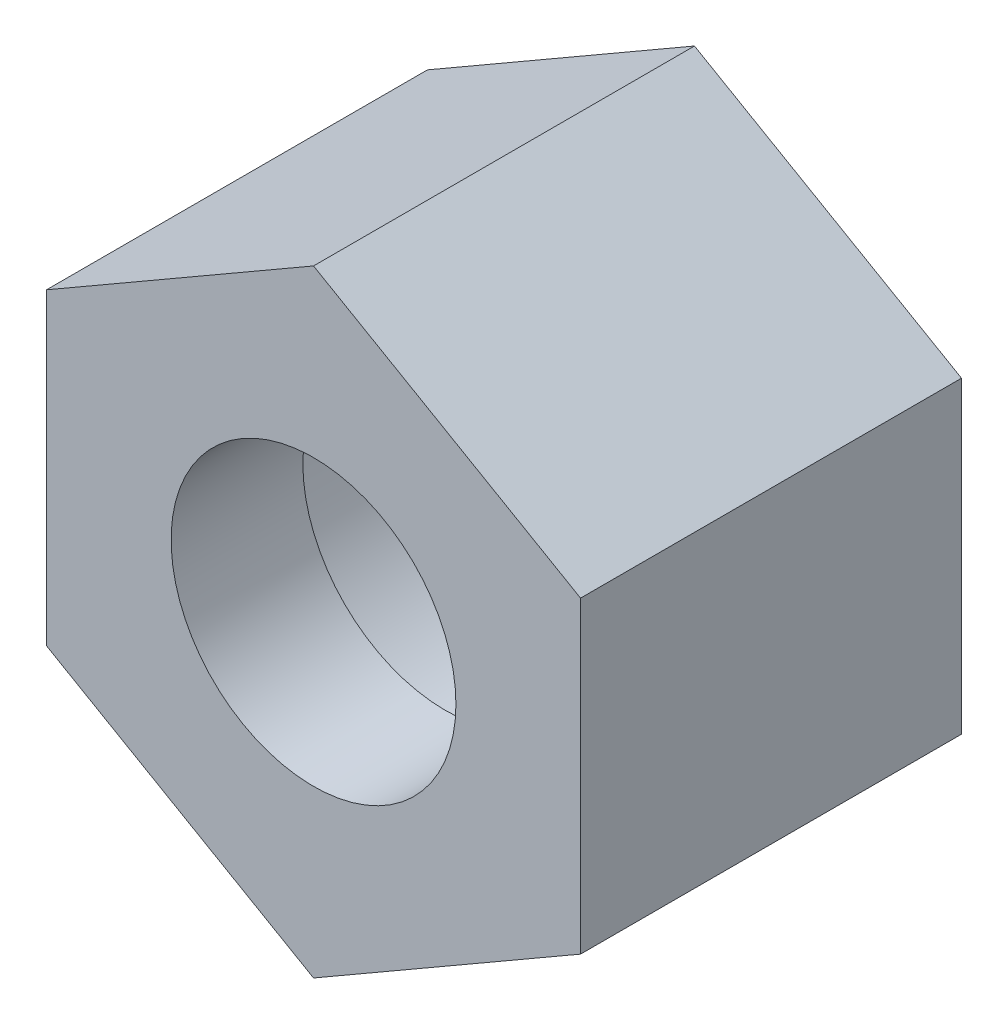
ISO-10303-21;
HEADER;
FILE_DESCRIPTION(('STEP AP214'),'2;1');
FILE_NAME('part.step','',(''),(''),'','','');
FILE_SCHEMA(('AUTOMOTIVE_DESIGN { 1 0 10303 214 1 1 1 1 }'));
ENDSEC;
DATA;
#1=APPLICATION_CONTEXT('core data for automotive mechanical design processes');
#2=APPLICATION_PROTOCOL_DEFINITION('international standard','automotive_design',2000,#1);
#3=PRODUCT_CONTEXT('',#1,'mechanical');
#4=PRODUCT('Part','Part','',(#3));
#5=PRODUCT_RELATED_PRODUCT_CATEGORY('part','',(#4));
#6=PRODUCT_DEFINITION_FORMATION('','',#4);
#7=PRODUCT_DEFINITION_CONTEXT('part definition',#1,'design');
#8=PRODUCT_DEFINITION('design','',#6,#7);
#9=PRODUCT_DEFINITION_SHAPE('','',#8);
#10=(LENGTH_UNIT() NAMED_UNIT(*) SI_UNIT(.MILLI.,.METRE.));
#11=(NAMED_UNIT(*) PLANE_ANGLE_UNIT() SI_UNIT($,.RADIAN.));
#12=(NAMED_UNIT(*) SI_UNIT($,.STERADIAN.) SOLID_ANGLE_UNIT());
#13=UNCERTAINTY_MEASURE_WITH_UNIT(LENGTH_MEASURE(1.E-05),#10,'distance_accuracy_value','');
#14=(GEOMETRIC_REPRESENTATION_CONTEXT(3) GLOBAL_UNCERTAINTY_ASSIGNED_CONTEXT((#13)) GLOBAL_UNIT_ASSIGNED_CONTEXT((#10,
#11,#12)) REPRESENTATION_CONTEXT('',''));
#15=CARTESIAN_POINT('',(0.,0.,0.));
#16=DIRECTION('',(0.,0.,1.));
#17=DIRECTION('',(1.,0.,0.));
#18=AXIS2_PLACEMENT_3D('',#15,#16,#17);
#19=CARTESIAN_POINT('',(15.,8.66025403784439,21.4));
#20=DIRECTION('',(-0.5,-0.866025403784439,0.));
#21=DIRECTION('',(0.866025403784439,-0.5,0.));
#22=AXIS2_PLACEMENT_3D('',#19,#20,#21);
#23=PLANE('',#22);
#24=DIRECTION('',(-0.866025403784439,0.5,0.));
#25=VECTOR('',#24,1.);
#26=CARTESIAN_POINT('',(15.,8.66025403784439,0.));
#27=LINE('',#26,#25);
#28=CARTESIAN_POINT('',(15.,8.66025403784439,0.));
#29=VERTEX_POINT('',#28);
#30=CARTESIAN_POINT('',(0.,17.3205080756888,0.));
#31=VERTEX_POINT('',#30);
#32=EDGE_CURVE('E119',#29,#31,#27,.T.);
#33=ORIENTED_EDGE('',*,*,#32,.T.);
#34=DIRECTION('',(0.,0.,-1.));
#35=VECTOR('',#34,1.);
#36=CARTESIAN_POINT('',(0.,17.3205080756888,21.4));
#37=LINE('',#36,#35);
#38=CARTESIAN_POINT('',(0.,17.3205080756888,21.4));
#39=VERTEX_POINT('',#38);
#40=EDGE_CURVE('E11',#39,#31,#37,.T.);
#41=ORIENTED_EDGE('',*,*,#40,.F.);
#42=DIRECTION('',(-0.866025403784439,0.5,0.));
#43=VECTOR('',#42,1.);
#44=CARTESIAN_POINT('',(15.,8.66025403784439,21.4));
#45=LINE('',#44,#43);
#46=CARTESIAN_POINT('',(15.,8.66025403784439,21.4));
#47=VERTEX_POINT('',#46);
#48=EDGE_CURVE('E130',#47,#39,#45,.T.);
#49=ORIENTED_EDGE('',*,*,#48,.F.);
#50=DIRECTION('',(0.,0.,-1.));
#51=VECTOR('',#50,1.);
#52=CARTESIAN_POINT('',(15.,8.66025403784439,21.4));
#53=LINE('',#52,#51);
#54=EDGE_CURVE('E115',#47,#29,#53,.T.);
#55=ORIENTED_EDGE('',*,*,#54,.T.);
#56=EDGE_LOOP('',(#33,#41,#49,#55));
#57=FACE_BOUND('',#56,.T.);
#58=ADVANCED_FACE('F34',(#57),#23,.F.);
#59=CARTESIAN_POINT('',(0.,17.3205080756888,21.4));
#60=DIRECTION('',(0.5,-0.866025403784439,0.));
#61=DIRECTION('',(0.866025403784439,0.5,0.));
#62=AXIS2_PLACEMENT_3D('',#59,#60,#61);
#63=PLANE('',#62);
#64=DIRECTION('',(-0.866025403784439,-0.5,0.));
#65=VECTOR('',#64,1.);
#66=CARTESIAN_POINT('',(0.,17.3205080756888,0.));
#67=LINE('',#66,#65);
#68=CARTESIAN_POINT('',(-15.,8.66025403784439,0.));
#69=VERTEX_POINT('',#68);
#70=EDGE_CURVE('E122',#31,#69,#67,.T.);
#71=ORIENTED_EDGE('',*,*,#70,.T.);
#72=DIRECTION('',(0.,0.,-1.));
#73=VECTOR('',#72,1.);
#74=CARTESIAN_POINT('',(-15.,8.66025403784439,21.4));
#75=LINE('',#74,#73);
#76=CARTESIAN_POINT('',(-15.,8.66025403784439,21.4));
#77=VERTEX_POINT('',#76);
#78=EDGE_CURVE('E43',#77,#69,#75,.T.);
#79=ORIENTED_EDGE('',*,*,#78,.F.);
#80=DIRECTION('',(-0.866025403784439,-0.5,0.));
#81=VECTOR('',#80,1.);
#82=CARTESIAN_POINT('',(0.,17.3205080756888,21.4));
#83=LINE('',#82,#81);
#84=EDGE_CURVE('E88',#39,#77,#83,.T.);
#85=ORIENTED_EDGE('',*,*,#84,.F.);
#86=ORIENTED_EDGE('',*,*,#40,.T.);
#87=EDGE_LOOP('',(#71,#79,#85,#86));
#88=FACE_BOUND('',#87,.T.);
#89=ADVANCED_FACE('F156',(#88),#63,.F.);
#90=CARTESIAN_POINT('',(-15.,8.66025403784439,21.4));
#91=DIRECTION('',(1.,0.,0.));
#92=DIRECTION('',(0.,1.,0.));
#93=AXIS2_PLACEMENT_3D('',#90,#91,#92);
#94=PLANE('',#93);
#95=DIRECTION('',(0.,-1.,0.));
#96=VECTOR('',#95,1.);
#97=CARTESIAN_POINT('',(-15.,8.66025403784439,0.));
#98=LINE('',#97,#96);
#99=CARTESIAN_POINT('',(-15.,-8.66025403784439,0.));
#100=VERTEX_POINT('',#99);
#101=EDGE_CURVE('E125',#69,#100,#98,.T.);
#102=ORIENTED_EDGE('',*,*,#101,.T.);
#103=DIRECTION('',(0.,0.,-1.));
#104=VECTOR('',#103,1.);
#105=CARTESIAN_POINT('',(-15.,-8.66025403784439,21.4));
#106=LINE('',#105,#104);
#107=CARTESIAN_POINT('',(-15.,-8.66025403784439,21.4));
#108=VERTEX_POINT('',#107);
#109=EDGE_CURVE('E110',#108,#100,#106,.T.);
#110=ORIENTED_EDGE('',*,*,#109,.F.);
#111=DIRECTION('',(0.,-1.,0.));
#112=VECTOR('',#111,1.);
#113=CARTESIAN_POINT('',(-15.,8.66025403784439,21.4));
#114=LINE('',#113,#112);
#115=EDGE_CURVE('E101',#77,#108,#114,.T.);
#116=ORIENTED_EDGE('',*,*,#115,.F.);
#117=ORIENTED_EDGE('',*,*,#78,.T.);
#118=EDGE_LOOP('',(#102,#110,#116,#117));
#119=FACE_BOUND('',#118,.T.);
#120=ADVANCED_FACE('F137',(#119),#94,.F.);
#121=CARTESIAN_POINT('',(-15.,-8.66025403784439,21.4));
#122=DIRECTION('',(0.5,0.866025403784439,0.));
#123=DIRECTION('',(-0.866025403784439,0.5,0.));
#124=AXIS2_PLACEMENT_3D('',#121,#122,#123);
#125=PLANE('',#124);
#126=DIRECTION('',(0.866025403784439,-0.5,0.));
#127=VECTOR('',#126,1.);
#128=CARTESIAN_POINT('',(-15.,-8.66025403784439,0.));
#129=LINE('',#128,#127);
#130=CARTESIAN_POINT('',(0.,-17.3205080756888,0.));
#131=VERTEX_POINT('',#130);
#132=EDGE_CURVE('E109',#100,#131,#129,.T.);
#133=ORIENTED_EDGE('',*,*,#132,.T.);
#134=DIRECTION('',(0.,0.,-1.));
#135=VECTOR('',#134,1.);
#136=CARTESIAN_POINT('',(0.,-17.3205080756888,21.4));
#137=LINE('',#136,#135);
#138=CARTESIAN_POINT('',(0.,-17.3205080756888,21.4));
#139=VERTEX_POINT('',#138);
#140=EDGE_CURVE('E106',#139,#131,#137,.T.);
#141=ORIENTED_EDGE('',*,*,#140,.F.);
#142=DIRECTION('',(0.866025403784439,-0.5,0.));
#143=VECTOR('',#142,1.);
#144=CARTESIAN_POINT('',(-15.,-8.66025403784439,21.4));
#145=LINE('',#144,#143);
#146=EDGE_CURVE('E95',#108,#139,#145,.T.);
#147=ORIENTED_EDGE('',*,*,#146,.F.);
#148=ORIENTED_EDGE('',*,*,#109,.T.);
#149=EDGE_LOOP('',(#133,#141,#147,#148));
#150=FACE_BOUND('',#149,.T.);
#151=ADVANCED_FACE('F107',(#150),#125,.F.);
#152=CARTESIAN_POINT('',(0.,-17.3205080756888,21.4));
#153=DIRECTION('',(-0.5,0.866025403784439,0.));
#154=DIRECTION('',(-0.866025403784439,-0.5,0.));
#155=AXIS2_PLACEMENT_3D('',#152,#153,#154);
#156=PLANE('',#155);
#157=DIRECTION('',(0.866025403784439,0.5,0.));
#158=VECTOR('',#157,1.);
#159=CARTESIAN_POINT('',(0.,-17.3205080756888,0.));
#160=LINE('',#159,#158);
#161=CARTESIAN_POINT('',(15.,-8.66025403784439,0.));
#162=VERTEX_POINT('',#161);
#163=EDGE_CURVE('E74',#131,#162,#160,.T.);
#164=ORIENTED_EDGE('',*,*,#163,.T.);
#165=DIRECTION('',(0.,0.,-1.));
#166=VECTOR('',#165,1.);
#167=CARTESIAN_POINT('',(15.,-8.66025403784439,21.4));
#168=LINE('',#167,#166);
#169=CARTESIAN_POINT('',(15.,-8.66025403784439,21.4));
#170=VERTEX_POINT('',#169);
#171=EDGE_CURVE('E111',#170,#162,#168,.T.);
#172=ORIENTED_EDGE('',*,*,#171,.F.);
#173=DIRECTION('',(0.866025403784439,0.5,0.));
#174=VECTOR('',#173,1.);
#175=CARTESIAN_POINT('',(0.,-17.3205080756888,21.4));
#176=LINE('',#175,#174);
#177=EDGE_CURVE('E99',#139,#170,#176,.T.);
#178=ORIENTED_EDGE('',*,*,#177,.F.);
#179=ORIENTED_EDGE('',*,*,#140,.T.);
#180=EDGE_LOOP('',(#164,#172,#178,#179));
#181=FACE_BOUND('',#180,.T.);
#182=ADVANCED_FACE('F113',(#181),#156,.F.);
#183=CARTESIAN_POINT('',(15.,-8.66025403784439,21.4));
#184=DIRECTION('',(-1.,0.,0.));
#185=DIRECTION('',(0.,-1.,0.));
#186=AXIS2_PLACEMENT_3D('',#183,#184,#185);
#187=PLANE('',#186);
#188=DIRECTION('',(0.,1.,0.));
#189=VECTOR('',#188,1.);
#190=CARTESIAN_POINT('',(15.,-8.66025403784439,0.));
#191=LINE('',#190,#189);
#192=EDGE_CURVE('E80',#162,#29,#191,.T.);
#193=ORIENTED_EDGE('',*,*,#192,.T.);
#194=ORIENTED_EDGE('',*,*,#54,.F.);
#195=DIRECTION('',(0.,1.,0.));
#196=VECTOR('',#195,1.);
#197=CARTESIAN_POINT('',(15.,-8.66025403784439,21.4));
#198=LINE('',#197,#196);
#199=EDGE_CURVE('E51',#170,#47,#198,.T.);
#200=ORIENTED_EDGE('',*,*,#199,.F.);
#201=ORIENTED_EDGE('',*,*,#171,.T.);
#202=EDGE_LOOP('',(#193,#194,#200,#201));
#203=FACE_BOUND('',#202,.T.);
#204=ADVANCED_FACE('F144',(#203),#187,.F.);
#205=CARTESIAN_POINT('',(0.,17.3205080756888,21.4));
#206=DIRECTION('',(0.,0.,1.));
#207=DIRECTION('',(1.,0.,0.));
#208=AXIS2_PLACEMENT_3D('',#205,#206,#207);
#209=PLANE('',#208);
#210=CARTESIAN_POINT('',(0.,0.,21.4));
#211=DIRECTION('',(0.,0.,1.));
#212=DIRECTION('',(1.,0.,0.));
#213=AXIS2_PLACEMENT_3D('',#210,#211,#212);
#214=CIRCLE('',#213,8.);
#215=CARTESIAN_POINT('',(8.,0.,21.4));
#216=VERTEX_POINT('',#215);
#217=EDGE_CURVE('E231',#216,#216,#214,.T.);
#218=ORIENTED_EDGE('',*,*,#217,.F.);
#219=EDGE_LOOP('',(#218));
#220=FACE_BOUND('',#219,.T.);
#221=ORIENTED_EDGE('',*,*,#48,.T.);
#222=ORIENTED_EDGE('',*,*,#84,.T.);
#223=ORIENTED_EDGE('',*,*,#115,.T.);
#224=ORIENTED_EDGE('',*,*,#146,.T.);
#225=ORIENTED_EDGE('',*,*,#177,.T.);
#226=ORIENTED_EDGE('',*,*,#199,.T.);
#227=EDGE_LOOP('',(#221,#222,#223,#224,#225,#226));
#228=FACE_BOUND('',#227,.T.);
#229=ADVANCED_FACE('F97',(#220,#228),#209,.T.);
#230=CARTESIAN_POINT('',(0.,17.3205080756888,0.));
#231=DIRECTION('',(0.,0.,1.));
#232=DIRECTION('',(1.,0.,0.));
#233=AXIS2_PLACEMENT_3D('',#230,#231,#232);
#234=PLANE('',#233);
#235=CARTESIAN_POINT('',(0.,0.,0.));
#236=DIRECTION('',(0.,0.,-1.));
#237=DIRECTION('',(-1.,0.,0.));
#238=AXIS2_PLACEMENT_3D('',#235,#236,#237);
#239=CIRCLE('',#238,11.25);
#240=CARTESIAN_POINT('',(-11.25,0.,0.));
#241=VERTEX_POINT('',#240);
#242=EDGE_CURVE('E233',#241,#241,#239,.T.);
#243=ORIENTED_EDGE('',*,*,#242,.F.);
#244=EDGE_LOOP('',(#243));
#245=FACE_BOUND('',#244,.T.);
#246=ORIENTED_EDGE('',*,*,#32,.F.);
#247=ORIENTED_EDGE('',*,*,#192,.F.);
#248=ORIENTED_EDGE('',*,*,#163,.F.);
#249=ORIENTED_EDGE('',*,*,#132,.F.);
#250=ORIENTED_EDGE('',*,*,#101,.F.);
#251=ORIENTED_EDGE('',*,*,#70,.F.);
#252=EDGE_LOOP('',(#246,#247,#248,#249,#250,#251));
#253=FACE_BOUND('',#252,.T.);
#254=ADVANCED_FACE('F140',(#245,#253),#234,.F.);
#255=CARTESIAN_POINT('',(0.,0.,14.));
#256=DIRECTION('',(0.,0.,-1.));
#257=DIRECTION('',(-1.,0.,0.));
#258=AXIS2_PLACEMENT_3D('',#255,#256,#257);
#259=CYLINDRICAL_SURFACE('',#258,11.25);
#260=CARTESIAN_POINT('',(0.,0.,14.));
#261=DIRECTION('',(0.,0.,-1.));
#262=DIRECTION('',(-1.,0.,0.));
#263=AXIS2_PLACEMENT_3D('',#260,#261,#262);
#264=CIRCLE('',#263,11.25);
#265=CARTESIAN_POINT('',(-11.25,0.,14.));
#266=VERTEX_POINT('',#265);
#267=EDGE_CURVE('E123',#266,#266,#264,.T.);
#268=ORIENTED_EDGE('',*,*,#267,.F.);
#269=EDGE_LOOP('',(#268));
#270=FACE_BOUND('',#269,.T.);
#271=ORIENTED_EDGE('',*,*,#242,.T.);
#272=EDGE_LOOP('',(#271));
#273=FACE_BOUND('',#272,.T.);
#274=ADVANCED_FACE('F188',(#270,#273),#259,.F.);
#275=CARTESIAN_POINT('',(0.,0.,14.));
#276=DIRECTION('',(0.,0.,-1.));
#277=DIRECTION('',(-1.,0.,0.));
#278=AXIS2_PLACEMENT_3D('',#275,#276,#277);
#279=PLANE('',#278);
#280=CARTESIAN_POINT('',(0.,0.,14.));
#281=DIRECTION('',(0.,0.,-1.));
#282=DIRECTION('',(-1.,0.,0.));
#283=AXIS2_PLACEMENT_3D('',#280,#281,#282);
#284=CIRCLE('',#283,8.);
#285=CARTESIAN_POINT('',(-8.,0.,14.));
#286=VERTEX_POINT('',#285);
#287=EDGE_CURVE('E37',#286,#286,#284,.T.);
#288=ORIENTED_EDGE('',*,*,#287,.F.);
#289=EDGE_LOOP('',(#288));
#290=FACE_BOUND('',#289,.T.);
#291=ORIENTED_EDGE('',*,*,#267,.T.);
#292=EDGE_LOOP('',(#291));
#293=FACE_BOUND('',#292,.T.);
#294=ADVANCED_FACE('F197',(#290,#293),#279,.T.);
#295=CARTESIAN_POINT('',(0.,0.,0.));
#296=DIRECTION('',(0.,0.,1.));
#297=DIRECTION('',(1.,0.,0.));
#298=AXIS2_PLACEMENT_3D('',#295,#296,#297);
#299=CYLINDRICAL_SURFACE('',#298,8.);
#300=ORIENTED_EDGE('',*,*,#287,.T.);
#301=EDGE_LOOP('',(#300));
#302=FACE_BOUND('',#301,.T.);
#303=ORIENTED_EDGE('',*,*,#217,.T.);
#304=EDGE_LOOP('',(#303));
#305=FACE_BOUND('',#304,.T.);
#306=ADVANCED_FACE('F212',(#302,#305),#299,.F.);
#307=CLOSED_SHELL('',(#58,#89,#120,#151,#182,#204,#229,#254,#274,#294,#306));
#308=MANIFOLD_SOLID_BREP('B2',#307);
#309=ADVANCED_BREP_SHAPE_REPRESENTATION('',(#18,#308),#14);
#310=SHAPE_DEFINITION_REPRESENTATION(#9,#309);
ENDSEC;
END-ISO-10303-21;
